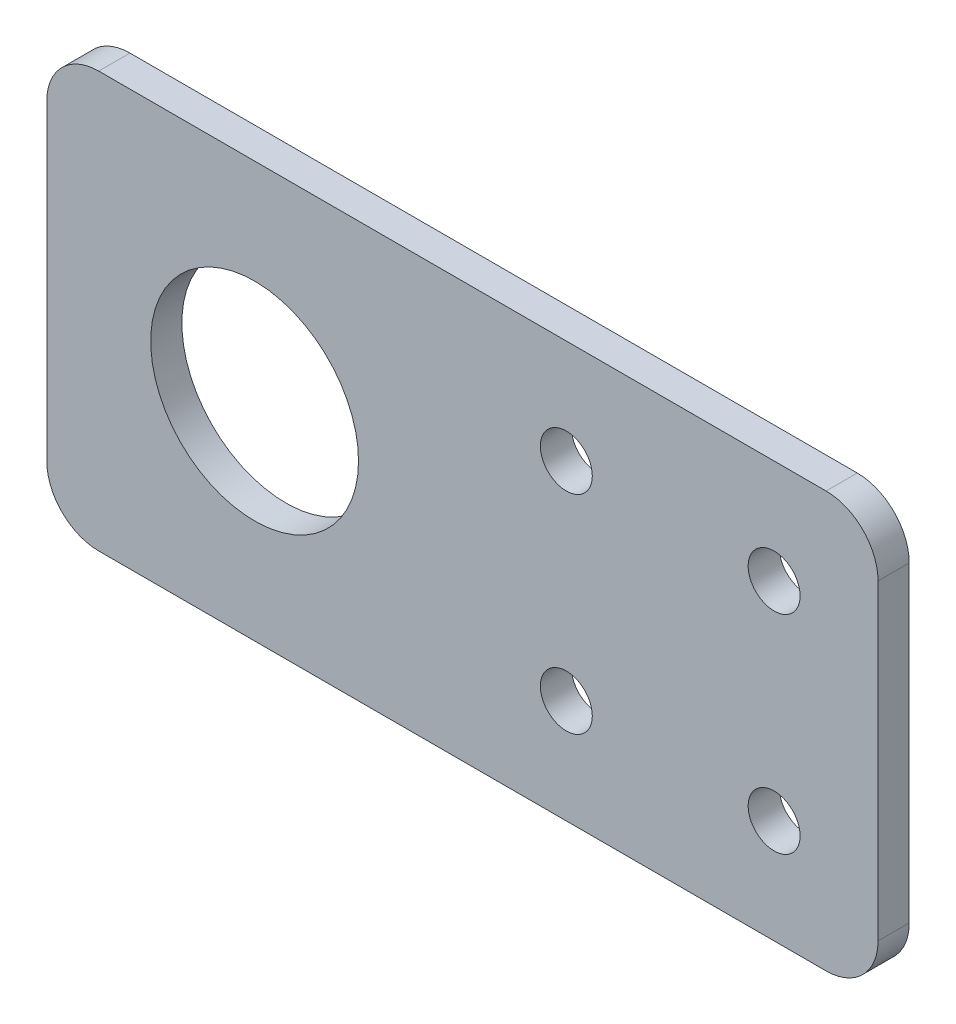
ISO-10303-21;
HEADER;
FILE_DESCRIPTION(('STEP AP214'),'2;1');
FILE_NAME('part.step','',(''),(''),'','','');
FILE_SCHEMA(('AUTOMOTIVE_DESIGN { 1 0 10303 214 1 1 1 1 }'));
ENDSEC;
DATA;
#1=APPLICATION_CONTEXT('core data for automotive mechanical design processes');
#2=APPLICATION_PROTOCOL_DEFINITION('international standard','automotive_design',2000,#1);
#3=PRODUCT_CONTEXT('',#1,'mechanical');
#4=PRODUCT('Part','Part','',(#3));
#5=PRODUCT_RELATED_PRODUCT_CATEGORY('part','',(#4));
#6=PRODUCT_DEFINITION_FORMATION('','',#4);
#7=PRODUCT_DEFINITION_CONTEXT('part definition',#1,'design');
#8=PRODUCT_DEFINITION('design','',#6,#7);
#9=PRODUCT_DEFINITION_SHAPE('','',#8);
#10=(LENGTH_UNIT() NAMED_UNIT(*) SI_UNIT(.MILLI.,.METRE.));
#11=(NAMED_UNIT(*) PLANE_ANGLE_UNIT() SI_UNIT($,.RADIAN.));
#12=(NAMED_UNIT(*) SI_UNIT($,.STERADIAN.) SOLID_ANGLE_UNIT());
#13=UNCERTAINTY_MEASURE_WITH_UNIT(LENGTH_MEASURE(1.E-05),#10,'distance_accuracy_value','');
#14=(GEOMETRIC_REPRESENTATION_CONTEXT(3) GLOBAL_UNCERTAINTY_ASSIGNED_CONTEXT((#13)) GLOBAL_UNIT_ASSIGNED_CONTEXT((#10,
#11,#12)) REPRESENTATION_CONTEXT('',''));
#15=CARTESIAN_POINT('',(0.,0.,0.));
#16=DIRECTION('',(0.,0.,1.));
#17=DIRECTION('',(1.,0.,0.));
#18=AXIS2_PLACEMENT_3D('',#15,#16,#17);
#19=CARTESIAN_POINT('',(0.,0.,3.));
#20=DIRECTION('',(0.,0.,1.));
#21=DIRECTION('',(1.,0.,0.));
#22=AXIS2_PLACEMENT_3D('',#19,#20,#21);
#23=PLANE('',#22);
#24=CARTESIAN_POINT('',(-30.,-10.,3.));
#25=DIRECTION('',(0.,0.,1.));
#26=DIRECTION('',(1.,0.,0.));
#27=AXIS2_PLACEMENT_3D('',#24,#25,#26);
#28=CIRCLE('',#27,2.5);
#29=CARTESIAN_POINT('',(-27.5,-10.,3.));
#30=VERTEX_POINT('',#29);
#31=EDGE_CURVE('E187',#30,#30,#28,.T.);
#32=ORIENTED_EDGE('',*,*,#31,.F.);
#33=EDGE_LOOP('',(#32));
#34=FACE_BOUND('',#33,.T.);
#35=CARTESIAN_POINT('',(-10.,9.99999999999997,3.));
#36=DIRECTION('',(0.,0.,1.));
#37=DIRECTION('',(1.,0.,0.));
#38=AXIS2_PLACEMENT_3D('',#35,#36,#37);
#39=CIRCLE('',#38,2.5);
#40=CARTESIAN_POINT('',(-7.5,9.99999999999997,3.));
#41=VERTEX_POINT('',#40);
#42=EDGE_CURVE('E176',#41,#41,#39,.T.);
#43=ORIENTED_EDGE('',*,*,#42,.F.);
#44=EDGE_LOOP('',(#43));
#45=FACE_BOUND('',#44,.T.);
#46=DIRECTION('',(1.,0.,0.));
#47=VECTOR('',#46,1.);
#48=CARTESIAN_POINT('',(-80.,-20.,3.));
#49=LINE('',#48,#47);
#50=CARTESIAN_POINT('',(-75.,-20.,3.));
#51=VERTEX_POINT('',#50);
#52=CARTESIAN_POINT('',(-4.99999999999999,-20.,3.));
#53=VERTEX_POINT('',#52);
#54=EDGE_CURVE('E171',#51,#53,#49,.T.);
#55=ORIENTED_EDGE('',*,*,#54,.T.);
#56=CARTESIAN_POINT('',(-5.,-15.,3.));
#57=DIRECTION('',(0.,0.,1.));
#58=DIRECTION('',(1.,0.,0.));
#59=AXIS2_PLACEMENT_3D('',#56,#57,#58);
#60=CIRCLE('',#59,5.);
#61=CARTESIAN_POINT('',(0.,-15.,3.));
#62=VERTEX_POINT('',#61);
#63=EDGE_CURVE('E148',#53,#62,#60,.T.);
#64=ORIENTED_EDGE('',*,*,#63,.T.);
#65=DIRECTION('',(0.,1.,0.));
#66=VECTOR('',#65,1.);
#67=CARTESIAN_POINT('',(0.,20.,3.));
#68=LINE('',#67,#66);
#69=CARTESIAN_POINT('',(0.,15.,3.));
#70=VERTEX_POINT('',#69);
#71=EDGE_CURVE('E118',#62,#70,#68,.T.);
#72=ORIENTED_EDGE('',*,*,#71,.T.);
#73=CARTESIAN_POINT('',(-5.,15.,3.));
#74=DIRECTION('',(0.,0.,1.));
#75=DIRECTION('',(1.,0.,0.));
#76=AXIS2_PLACEMENT_3D('',#73,#74,#75);
#77=CIRCLE('',#76,5.);
#78=CARTESIAN_POINT('',(-5.,20.,3.));
#79=VERTEX_POINT('',#78);
#80=EDGE_CURVE('E55',#70,#79,#77,.T.);
#81=ORIENTED_EDGE('',*,*,#80,.T.);
#82=DIRECTION('',(-1.,0.,0.));
#83=VECTOR('',#82,1.);
#84=CARTESIAN_POINT('',(-80.,20.,3.));
#85=LINE('',#84,#83);
#86=CARTESIAN_POINT('',(-75.,20.,3.));
#87=VERTEX_POINT('',#86);
#88=EDGE_CURVE('E134',#79,#87,#85,.T.);
#89=ORIENTED_EDGE('',*,*,#88,.T.);
#90=CARTESIAN_POINT('',(-75.,15.,3.));
#91=DIRECTION('',(0.,0.,1.));
#92=DIRECTION('',(1.,0.,0.));
#93=AXIS2_PLACEMENT_3D('',#90,#91,#92);
#94=CIRCLE('',#93,5.);
#95=CARTESIAN_POINT('',(-80.,15.,3.));
#96=VERTEX_POINT('',#95);
#97=EDGE_CURVE('E143',#87,#96,#94,.T.);
#98=ORIENTED_EDGE('',*,*,#97,.T.);
#99=DIRECTION('',(0.,-1.,0.));
#100=VECTOR('',#99,1.);
#101=CARTESIAN_POINT('',(-80.,20.,3.));
#102=LINE('',#101,#100);
#103=CARTESIAN_POINT('',(-80.,-15.,3.));
#104=VERTEX_POINT('',#103);
#105=EDGE_CURVE('E128',#96,#104,#102,.T.);
#106=ORIENTED_EDGE('',*,*,#105,.T.);
#107=CARTESIAN_POINT('',(-75.,-15.,3.));
#108=DIRECTION('',(0.,0.,1.));
#109=DIRECTION('',(1.,0.,0.));
#110=AXIS2_PLACEMENT_3D('',#107,#108,#109);
#111=CIRCLE('',#110,5.);
#112=EDGE_CURVE('E145',#104,#51,#111,.T.);
#113=ORIENTED_EDGE('',*,*,#112,.T.);
#114=EDGE_LOOP('',(#55,#64,#72,#81,#89,#98,#106,#113));
#115=FACE_BOUND('',#114,.T.);
#116=CARTESIAN_POINT('',(-60.,0.,3.));
#117=DIRECTION('',(0.,0.,1.));
#118=DIRECTION('',(1.,0.,0.));
#119=AXIS2_PLACEMENT_3D('',#116,#117,#118);
#120=CIRCLE('',#119,10.);
#121=CARTESIAN_POINT('',(-50.,0.,3.));
#122=VERTEX_POINT('',#121);
#123=EDGE_CURVE('E164',#122,#122,#120,.T.);
#124=ORIENTED_EDGE('',*,*,#123,.F.);
#125=EDGE_LOOP('',(#124));
#126=FACE_BOUND('',#125,.T.);
#127=CARTESIAN_POINT('',(-10.,-10.,3.));
#128=DIRECTION('',(0.,0.,1.));
#129=DIRECTION('',(1.,0.,0.));
#130=AXIS2_PLACEMENT_3D('',#127,#128,#129);
#131=CIRCLE('',#130,2.5);
#132=CARTESIAN_POINT('',(-7.5,-10.,3.));
#133=VERTEX_POINT('',#132);
#134=EDGE_CURVE('E181',#133,#133,#131,.T.);
#135=ORIENTED_EDGE('',*,*,#134,.F.);
#136=EDGE_LOOP('',(#135));
#137=FACE_BOUND('',#136,.T.);
#138=CARTESIAN_POINT('',(-30.,9.99999999999997,3.));
#139=DIRECTION('',(0.,0.,1.));
#140=DIRECTION('',(1.,0.,0.));
#141=AXIS2_PLACEMENT_3D('',#138,#139,#140);
#142=CIRCLE('',#141,2.5);
#143=CARTESIAN_POINT('',(-27.5,9.99999999999997,3.));
#144=VERTEX_POINT('',#143);
#145=EDGE_CURVE('E193',#144,#144,#142,.T.);
#146=ORIENTED_EDGE('',*,*,#145,.F.);
#147=EDGE_LOOP('',(#146));
#148=FACE_BOUND('',#147,.T.);
#149=ADVANCED_FACE('F33',(#34,#45,#115,#126,#137,#148),#23,.T.);
#150=CARTESIAN_POINT('',(0.,0.,0.));
#151=DIRECTION('',(0.,0.,1.));
#152=DIRECTION('',(1.,0.,0.));
#153=AXIS2_PLACEMENT_3D('',#150,#151,#152);
#154=PLANE('',#153);
#155=CARTESIAN_POINT('',(-30.,-10.,0.));
#156=DIRECTION('',(0.,0.,1.));
#157=DIRECTION('',(1.,0.,0.));
#158=AXIS2_PLACEMENT_3D('',#155,#156,#157);
#159=CIRCLE('',#158,2.5);
#160=CARTESIAN_POINT('',(-27.5,-10.,0.));
#161=VERTEX_POINT('',#160);
#162=EDGE_CURVE('E190',#161,#161,#159,.T.);
#163=ORIENTED_EDGE('',*,*,#162,.T.);
#164=EDGE_LOOP('',(#163));
#165=FACE_BOUND('',#164,.T.);
#166=CARTESIAN_POINT('',(-10.,9.99999999999997,0.));
#167=DIRECTION('',(0.,0.,1.));
#168=DIRECTION('',(1.,0.,0.));
#169=AXIS2_PLACEMENT_3D('',#166,#167,#168);
#170=CIRCLE('',#169,2.5);
#171=CARTESIAN_POINT('',(-7.5,9.99999999999997,0.));
#172=VERTEX_POINT('',#171);
#173=EDGE_CURVE('E178',#172,#172,#170,.T.);
#174=ORIENTED_EDGE('',*,*,#173,.T.);
#175=EDGE_LOOP('',(#174));
#176=FACE_BOUND('',#175,.T.);
#177=DIRECTION('',(0.,1.,0.));
#178=VECTOR('',#177,1.);
#179=CARTESIAN_POINT('',(0.,20.,0.));
#180=LINE('',#179,#178);
#181=CARTESIAN_POINT('',(0.,-15.,0.));
#182=VERTEX_POINT('',#181);
#183=CARTESIAN_POINT('',(0.,15.,0.));
#184=VERTEX_POINT('',#183);
#185=EDGE_CURVE('E116',#182,#184,#180,.T.);
#186=ORIENTED_EDGE('',*,*,#185,.F.);
#187=CARTESIAN_POINT('',(-5.,-15.,0.));
#188=DIRECTION('',(0.,0.,1.));
#189=DIRECTION('',(1.,0.,0.));
#190=AXIS2_PLACEMENT_3D('',#187,#188,#189);
#191=CIRCLE('',#190,5.);
#192=CARTESIAN_POINT('',(-4.99999999999999,-20.,0.));
#193=VERTEX_POINT('',#192);
#194=EDGE_CURVE('E99',#182,#193,#191,.F.);
#195=ORIENTED_EDGE('',*,*,#194,.T.);
#196=DIRECTION('',(1.,0.,0.));
#197=VECTOR('',#196,1.);
#198=CARTESIAN_POINT('',(-80.,-20.,0.));
#199=LINE('',#198,#197);
#200=CARTESIAN_POINT('',(-75.,-20.,0.));
#201=VERTEX_POINT('',#200);
#202=EDGE_CURVE('E126',#201,#193,#199,.T.);
#203=ORIENTED_EDGE('',*,*,#202,.F.);
#204=CARTESIAN_POINT('',(-75.,-15.,0.));
#205=DIRECTION('',(0.,0.,1.));
#206=DIRECTION('',(1.,0.,0.));
#207=AXIS2_PLACEMENT_3D('',#204,#205,#206);
#208=CIRCLE('',#207,5.);
#209=CARTESIAN_POINT('',(-80.,-15.,0.));
#210=VERTEX_POINT('',#209);
#211=EDGE_CURVE('E137',#201,#210,#208,.F.);
#212=ORIENTED_EDGE('',*,*,#211,.T.);
#213=DIRECTION('',(0.,-1.,0.));
#214=VECTOR('',#213,1.);
#215=CARTESIAN_POINT('',(-80.,20.,0.));
#216=LINE('',#215,#214);
#217=CARTESIAN_POINT('',(-80.,15.,0.));
#218=VERTEX_POINT('',#217);
#219=EDGE_CURVE('E130',#218,#210,#216,.T.);
#220=ORIENTED_EDGE('',*,*,#219,.F.);
#221=CARTESIAN_POINT('',(-75.,15.,0.));
#222=DIRECTION('',(0.,0.,1.));
#223=DIRECTION('',(1.,0.,0.));
#224=AXIS2_PLACEMENT_3D('',#221,#222,#223);
#225=CIRCLE('',#224,5.);
#226=CARTESIAN_POINT('',(-75.,20.,0.));
#227=VERTEX_POINT('',#226);
#228=EDGE_CURVE('E119',#218,#227,#225,.F.);
#229=ORIENTED_EDGE('',*,*,#228,.T.);
#230=DIRECTION('',(-1.,0.,0.));
#231=VECTOR('',#230,1.);
#232=CARTESIAN_POINT('',(-80.,20.,0.));
#233=LINE('',#232,#231);
#234=CARTESIAN_POINT('',(-5.,20.,0.));
#235=VERTEX_POINT('',#234);
#236=EDGE_CURVE('E125',#235,#227,#233,.T.);
#237=ORIENTED_EDGE('',*,*,#236,.F.);
#238=CARTESIAN_POINT('',(-5.,15.,0.));
#239=DIRECTION('',(0.,0.,1.));
#240=DIRECTION('',(1.,0.,0.));
#241=AXIS2_PLACEMENT_3D('',#238,#239,#240);
#242=CIRCLE('',#241,5.);
#243=EDGE_CURVE('E110',#235,#184,#242,.F.);
#244=ORIENTED_EDGE('',*,*,#243,.T.);
#245=EDGE_LOOP('',(#186,#195,#203,#212,#220,#229,#237,#244));
#246=FACE_BOUND('',#245,.T.);
#247=CARTESIAN_POINT('',(-60.,0.,0.));
#248=DIRECTION('',(0.,0.,1.));
#249=DIRECTION('',(1.,0.,0.));
#250=AXIS2_PLACEMENT_3D('',#247,#248,#249);
#251=CIRCLE('',#250,10.);
#252=CARTESIAN_POINT('',(-50.,0.,0.));
#253=VERTEX_POINT('',#252);
#254=EDGE_CURVE('E166',#253,#253,#251,.T.);
#255=ORIENTED_EDGE('',*,*,#254,.T.);
#256=EDGE_LOOP('',(#255));
#257=FACE_BOUND('',#256,.T.);
#258=CARTESIAN_POINT('',(-10.,-10.,0.));
#259=DIRECTION('',(0.,0.,1.));
#260=DIRECTION('',(1.,0.,0.));
#261=AXIS2_PLACEMENT_3D('',#258,#259,#260);
#262=CIRCLE('',#261,2.5);
#263=CARTESIAN_POINT('',(-7.5,-10.,0.));
#264=VERTEX_POINT('',#263);
#265=EDGE_CURVE('E184',#264,#264,#262,.T.);
#266=ORIENTED_EDGE('',*,*,#265,.T.);
#267=EDGE_LOOP('',(#266));
#268=FACE_BOUND('',#267,.T.);
#269=CARTESIAN_POINT('',(-30.,9.99999999999997,0.));
#270=DIRECTION('',(0.,0.,1.));
#271=DIRECTION('',(1.,0.,0.));
#272=AXIS2_PLACEMENT_3D('',#269,#270,#271);
#273=CIRCLE('',#272,2.5);
#274=CARTESIAN_POINT('',(-27.5,9.99999999999997,0.));
#275=VERTEX_POINT('',#274);
#276=EDGE_CURVE('E196',#275,#275,#273,.T.);
#277=ORIENTED_EDGE('',*,*,#276,.T.);
#278=EDGE_LOOP('',(#277));
#279=FACE_BOUND('',#278,.T.);
#280=ADVANCED_FACE('F122',(#165,#176,#246,#257,#268,#279),#154,.F.);
#281=CARTESIAN_POINT('',(-80.,20.,3.));
#282=DIRECTION('',(1.,0.,0.));
#283=DIRECTION('',(0.,1.,0.));
#284=AXIS2_PLACEMENT_3D('',#281,#282,#283);
#285=PLANE('',#284);
#286=ORIENTED_EDGE('',*,*,#219,.T.);
#287=DIRECTION('',(0.,0.,-1.));
#288=VECTOR('',#287,1.);
#289=CARTESIAN_POINT('',(-80.,-15.,3.));
#290=LINE('',#289,#288);
#291=EDGE_CURVE('E11',#210,#104,#290,.F.);
#292=ORIENTED_EDGE('',*,*,#291,.T.);
#293=ORIENTED_EDGE('',*,*,#105,.F.);
#294=DIRECTION('',(0.,0.,-1.));
#295=VECTOR('',#294,1.);
#296=CARTESIAN_POINT('',(-80.,15.,3.));
#297=LINE('',#296,#295);
#298=EDGE_CURVE('E41',#96,#218,#297,.T.);
#299=ORIENTED_EDGE('',*,*,#298,.T.);
#300=EDGE_LOOP('',(#286,#292,#293,#299));
#301=FACE_BOUND('',#300,.T.);
#302=ADVANCED_FACE('F159',(#301),#285,.F.);
#303=CARTESIAN_POINT('',(-80.,-20.,3.));
#304=DIRECTION('',(0.,1.,0.));
#305=DIRECTION('',(-1.,0.,0.));
#306=AXIS2_PLACEMENT_3D('',#303,#304,#305);
#307=PLANE('',#306);
#308=ORIENTED_EDGE('',*,*,#202,.T.);
#309=DIRECTION('',(0.,0.,-1.));
#310=VECTOR('',#309,1.);
#311=CARTESIAN_POINT('',(-4.99999999999999,-20.,3.));
#312=LINE('',#311,#310);
#313=EDGE_CURVE('E104',#193,#53,#312,.F.);
#314=ORIENTED_EDGE('',*,*,#313,.T.);
#315=ORIENTED_EDGE('',*,*,#54,.F.);
#316=DIRECTION('',(0.,0.,-1.));
#317=VECTOR('',#316,1.);
#318=CARTESIAN_POINT('',(-75.,-20.,3.));
#319=LINE('',#318,#317);
#320=EDGE_CURVE('E109',#51,#201,#319,.T.);
#321=ORIENTED_EDGE('',*,*,#320,.T.);
#322=EDGE_LOOP('',(#308,#314,#315,#321));
#323=FACE_BOUND('',#322,.T.);
#324=ADVANCED_FACE('F224',(#323),#307,.F.);
#325=CARTESIAN_POINT('',(0.,20.,3.));
#326=DIRECTION('',(-1.,0.,0.));
#327=DIRECTION('',(0.,-1.,0.));
#328=AXIS2_PLACEMENT_3D('',#325,#326,#327);
#329=PLANE('',#328);
#330=ORIENTED_EDGE('',*,*,#71,.F.);
#331=DIRECTION('',(0.,0.,-1.));
#332=VECTOR('',#331,1.);
#333=CARTESIAN_POINT('',(0.,-15.,3.));
#334=LINE('',#333,#332);
#335=EDGE_CURVE('E103',#62,#182,#334,.T.);
#336=ORIENTED_EDGE('',*,*,#335,.T.);
#337=ORIENTED_EDGE('',*,*,#185,.T.);
#338=DIRECTION('',(0.,0.,-1.));
#339=VECTOR('',#338,1.);
#340=CARTESIAN_POINT('',(0.,15.,3.));
#341=LINE('',#340,#339);
#342=EDGE_CURVE('E120',#184,#70,#341,.F.);
#343=ORIENTED_EDGE('',*,*,#342,.T.);
#344=EDGE_LOOP('',(#330,#336,#337,#343));
#345=FACE_BOUND('',#344,.T.);
#346=ADVANCED_FACE('F115',(#345),#329,.F.);
#347=CARTESIAN_POINT('',(-80.,20.,3.));
#348=DIRECTION('',(0.,-1.,0.));
#349=DIRECTION('',(1.,0.,0.));
#350=AXIS2_PLACEMENT_3D('',#347,#348,#349);
#351=PLANE('',#350);
#352=ORIENTED_EDGE('',*,*,#88,.F.);
#353=DIRECTION('',(0.,0.,-1.));
#354=VECTOR('',#353,1.);
#355=CARTESIAN_POINT('',(-5.,20.,3.));
#356=LINE('',#355,#354);
#357=EDGE_CURVE('E151',#79,#235,#356,.T.);
#358=ORIENTED_EDGE('',*,*,#357,.T.);
#359=ORIENTED_EDGE('',*,*,#236,.T.);
#360=DIRECTION('',(0.,0.,-1.));
#361=VECTOR('',#360,1.);
#362=CARTESIAN_POINT('',(-75.,20.,3.));
#363=LINE('',#362,#361);
#364=EDGE_CURVE('E48',#227,#87,#363,.F.);
#365=ORIENTED_EDGE('',*,*,#364,.T.);
#366=EDGE_LOOP('',(#352,#358,#359,#365));
#367=FACE_BOUND('',#366,.T.);
#368=ADVANCED_FACE('F219',(#367),#351,.F.);
#369=CARTESIAN_POINT('',(-60.,0.,3.));
#370=DIRECTION('',(0.,0.,-1.));
#371=DIRECTION('',(-1.,0.,0.));
#372=AXIS2_PLACEMENT_3D('',#369,#370,#371);
#373=CYLINDRICAL_SURFACE('',#372,10.);
#374=ORIENTED_EDGE('',*,*,#123,.T.);
#375=EDGE_LOOP('',(#374));
#376=FACE_BOUND('',#375,.T.);
#377=ORIENTED_EDGE('',*,*,#254,.F.);
#378=EDGE_LOOP('',(#377));
#379=FACE_BOUND('',#378,.T.);
#380=ADVANCED_FACE('F216',(#376,#379),#373,.F.);
#381=CARTESIAN_POINT('',(-10.,9.99999999999997,3.));
#382=DIRECTION('',(0.,0.,-1.));
#383=DIRECTION('',(-1.,0.,0.));
#384=AXIS2_PLACEMENT_3D('',#381,#382,#383);
#385=CYLINDRICAL_SURFACE('',#384,2.5);
#386=ORIENTED_EDGE('',*,*,#42,.T.);
#387=EDGE_LOOP('',(#386));
#388=FACE_BOUND('',#387,.T.);
#389=ORIENTED_EDGE('',*,*,#173,.F.);
#390=EDGE_LOOP('',(#389));
#391=FACE_BOUND('',#390,.T.);
#392=ADVANCED_FACE('F254',(#388,#391),#385,.F.);
#393=CARTESIAN_POINT('',(-10.,-10.,3.));
#394=DIRECTION('',(0.,0.,-1.));
#395=DIRECTION('',(-1.,0.,0.));
#396=AXIS2_PLACEMENT_3D('',#393,#394,#395);
#397=CYLINDRICAL_SURFACE('',#396,2.5);
#398=ORIENTED_EDGE('',*,*,#134,.T.);
#399=EDGE_LOOP('',(#398));
#400=FACE_BOUND('',#399,.T.);
#401=ORIENTED_EDGE('',*,*,#265,.F.);
#402=EDGE_LOOP('',(#401));
#403=FACE_BOUND('',#402,.T.);
#404=ADVANCED_FACE('F250',(#400,#403),#397,.F.);
#405=CARTESIAN_POINT('',(-30.,-10.,3.));
#406=DIRECTION('',(0.,0.,-1.));
#407=DIRECTION('',(-1.,0.,0.));
#408=AXIS2_PLACEMENT_3D('',#405,#406,#407);
#409=CYLINDRICAL_SURFACE('',#408,2.5);
#410=ORIENTED_EDGE('',*,*,#31,.T.);
#411=EDGE_LOOP('',(#410));
#412=FACE_BOUND('',#411,.T.);
#413=ORIENTED_EDGE('',*,*,#162,.F.);
#414=EDGE_LOOP('',(#413));
#415=FACE_BOUND('',#414,.T.);
#416=ADVANCED_FACE('F253',(#412,#415),#409,.F.);
#417=CARTESIAN_POINT('',(-30.,9.99999999999997,3.));
#418=DIRECTION('',(0.,0.,-1.));
#419=DIRECTION('',(-1.,0.,0.));
#420=AXIS2_PLACEMENT_3D('',#417,#418,#419);
#421=CYLINDRICAL_SURFACE('',#420,2.5);
#422=ORIENTED_EDGE('',*,*,#145,.T.);
#423=EDGE_LOOP('',(#422));
#424=FACE_BOUND('',#423,.T.);
#425=ORIENTED_EDGE('',*,*,#276,.F.);
#426=EDGE_LOOP('',(#425));
#427=FACE_BOUND('',#426,.T.);
#428=ADVANCED_FACE('F202',(#424,#427),#421,.F.);
#429=CARTESIAN_POINT('',(-5.,-15.,3.));
#430=DIRECTION('',(0.,0.,-1.));
#431=DIRECTION('',(-1.,0.,0.));
#432=AXIS2_PLACEMENT_3D('',#429,#430,#431);
#433=CYLINDRICAL_SURFACE('',#432,5.);
#434=ORIENTED_EDGE('',*,*,#63,.F.);
#435=ORIENTED_EDGE('',*,*,#313,.F.);
#436=ORIENTED_EDGE('',*,*,#194,.F.);
#437=ORIENTED_EDGE('',*,*,#335,.F.);
#438=EDGE_LOOP('',(#434,#435,#436,#437));
#439=FACE_BOUND('',#438,.T.);
#440=ADVANCED_FACE('F102',(#439),#433,.T.);
#441=CARTESIAN_POINT('',(-5.,15.,3.));
#442=DIRECTION('',(0.,0.,-1.));
#443=DIRECTION('',(-1.,0.,0.));
#444=AXIS2_PLACEMENT_3D('',#441,#442,#443);
#445=CYLINDRICAL_SURFACE('',#444,5.);
#446=ORIENTED_EDGE('',*,*,#80,.F.);
#447=ORIENTED_EDGE('',*,*,#342,.F.);
#448=ORIENTED_EDGE('',*,*,#243,.F.);
#449=ORIENTED_EDGE('',*,*,#357,.F.);
#450=EDGE_LOOP('',(#446,#447,#448,#449));
#451=FACE_BOUND('',#450,.T.);
#452=ADVANCED_FACE('F232',(#451),#445,.T.);
#453=CARTESIAN_POINT('',(-75.,-15.,3.));
#454=DIRECTION('',(0.,0.,-1.));
#455=DIRECTION('',(-1.,0.,0.));
#456=AXIS2_PLACEMENT_3D('',#453,#454,#455);
#457=CYLINDRICAL_SURFACE('',#456,5.);
#458=ORIENTED_EDGE('',*,*,#112,.F.);
#459=ORIENTED_EDGE('',*,*,#291,.F.);
#460=ORIENTED_EDGE('',*,*,#211,.F.);
#461=ORIENTED_EDGE('',*,*,#320,.F.);
#462=EDGE_LOOP('',(#458,#459,#460,#461));
#463=FACE_BOUND('',#462,.T.);
#464=ADVANCED_FACE('F234',(#463),#457,.T.);
#465=CARTESIAN_POINT('',(-75.,15.,3.));
#466=DIRECTION('',(0.,0.,-1.));
#467=DIRECTION('',(-1.,0.,0.));
#468=AXIS2_PLACEMENT_3D('',#465,#466,#467);
#469=CYLINDRICAL_SURFACE('',#468,5.);
#470=ORIENTED_EDGE('',*,*,#97,.F.);
#471=ORIENTED_EDGE('',*,*,#364,.F.);
#472=ORIENTED_EDGE('',*,*,#228,.F.);
#473=ORIENTED_EDGE('',*,*,#298,.F.);
#474=EDGE_LOOP('',(#470,#471,#472,#473));
#475=FACE_BOUND('',#474,.T.);
#476=ADVANCED_FACE('F35',(#475),#469,.T.);
#477=CLOSED_SHELL('',(#149,#280,#302,#324,#346,#368,#380,#392,#404,#416,#428,#440,#452,#464,#476));
#478=MANIFOLD_SOLID_BREP('B2',#477);
#479=ADVANCED_BREP_SHAPE_REPRESENTATION('',(#18,#478),#14);
#480=SHAPE_DEFINITION_REPRESENTATION(#9,#479);
ENDSEC;
END-ISO-10303-21;
